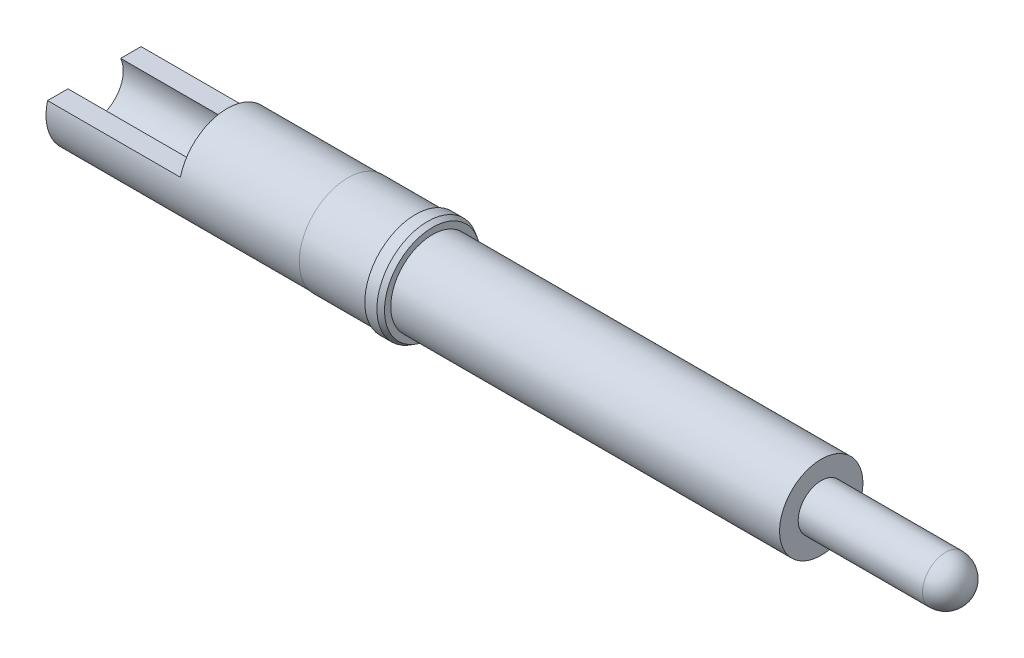
ISO-10303-21;
HEADER;
FILE_DESCRIPTION(('STEP AP214'),'2;1');
FILE_NAME('part.step','',(''),(''),'','','');
FILE_SCHEMA(('AUTOMOTIVE_DESIGN { 1 0 10303 214 1 1 1 1 }'));
ENDSEC;
DATA;
#1=APPLICATION_CONTEXT('core data for automotive mechanical design processes');
#2=APPLICATION_PROTOCOL_DEFINITION('international standard','automotive_design',2000,#1);
#3=PRODUCT_CONTEXT('',#1,'mechanical');
#4=PRODUCT('Part','Part','',(#3));
#5=PRODUCT_RELATED_PRODUCT_CATEGORY('part','',(#4));
#6=PRODUCT_DEFINITION_FORMATION('','',#4);
#7=PRODUCT_DEFINITION_CONTEXT('part definition',#1,'design');
#8=PRODUCT_DEFINITION('design','',#6,#7);
#9=PRODUCT_DEFINITION_SHAPE('','',#8);
#10=(LENGTH_UNIT() NAMED_UNIT(*) SI_UNIT(.MILLI.,.METRE.));
#11=(NAMED_UNIT(*) PLANE_ANGLE_UNIT() SI_UNIT($,.RADIAN.));
#12=(NAMED_UNIT(*) SI_UNIT($,.STERADIAN.) SOLID_ANGLE_UNIT());
#13=UNCERTAINTY_MEASURE_WITH_UNIT(LENGTH_MEASURE(1.E-05),#10,'distance_accuracy_value','');
#14=(GEOMETRIC_REPRESENTATION_CONTEXT(3) GLOBAL_UNCERTAINTY_ASSIGNED_CONTEXT((#13)) GLOBAL_UNIT_ASSIGNED_CONTEXT((#10,
#11,#12)) REPRESENTATION_CONTEXT('',''));
#15=CARTESIAN_POINT('',(0.,0.,0.));
#16=DIRECTION('',(0.,0.,1.));
#17=DIRECTION('',(1.,0.,0.));
#18=AXIS2_PLACEMENT_3D('',#15,#16,#17);
#19=CARTESIAN_POINT('',(0.,0.127,2.54));
#20=DIRECTION('',(0.,1.,0.));
#21=DIRECTION('',(0.,0.,1.));
#22=AXIS2_PLACEMENT_3D('',#19,#20,#21);
#23=PLANE('',#22);
#24=DIRECTION('',(-1.,0.,0.));
#25=VECTOR('',#24,1.);
#26=CARTESIAN_POINT('',(0.,0.127,-0.277081287711747));
#27=LINE('',#26,#25);
#28=CARTESIAN_POINT('',(0.,0.127,-0.277081287711747));
#29=VERTEX_POINT('',#28);
#30=CARTESIAN_POINT('',(1.397,0.127,-0.277081287711747));
#31=VERTEX_POINT('',#30);
#32=EDGE_CURVE('E88',#29,#31,#27,.F.);
#33=ORIENTED_EDGE('',*,*,#32,.T.);
#34=DIRECTION('',(0.,0.,-1.));
#35=VECTOR('',#34,1.);
#36=CARTESIAN_POINT('',(1.397,0.127,2.54));
#37=LINE('',#36,#35);
#38=CARTESIAN_POINT('',(1.397,0.127,-0.491868884968342));
#39=VERTEX_POINT('',#38);
#40=EDGE_CURVE('E106',#31,#39,#37,.T.);
#41=ORIENTED_EDGE('',*,*,#40,.T.);
#42=DIRECTION('',(-1.,0.,0.));
#43=VECTOR('',#42,1.);
#44=CARTESIAN_POINT('',(0.,0.127,-0.491868884968342));
#45=LINE('',#44,#43);
#46=CARTESIAN_POINT('',(0.,0.127,-0.491868884968342));
#47=VERTEX_POINT('',#46);
#48=EDGE_CURVE('E122',#39,#47,#45,.T.);
#49=ORIENTED_EDGE('',*,*,#48,.T.);
#50=DIRECTION('',(0.,0.,-1.));
#51=VECTOR('',#50,1.);
#52=CARTESIAN_POINT('',(0.,0.127,2.54));
#53=LINE('',#52,#51);
#54=EDGE_CURVE('E49',#29,#47,#53,.T.);
#55=ORIENTED_EDGE('',*,*,#54,.F.);
#56=EDGE_LOOP('',(#33,#41,#49,#55));
#57=FACE_BOUND('',#56,.T.);
#58=ADVANCED_FACE('F17',(#57),#23,.T.);
#59=CARTESIAN_POINT('',(2.667,0.,0.));
#60=DIRECTION('',(1.,0.,0.));
#61=DIRECTION('',(0.,0.861131258398696,-0.508382686377771));
#62=AXIS2_PLACEMENT_3D('',#59,#60,#61);
#63=PLANE('',#62);
#64=CARTESIAN_POINT('',(2.667,0.,0.));
#65=DIRECTION('',(1.,0.,0.));
#66=DIRECTION('',(0.,1.,0.));
#67=AXIS2_PLACEMENT_3D('',#64,#65,#66);
#68=CIRCLE('',#67,0.508);
#69=CARTESIAN_POINT('',(2.667,0.508,0.));
#70=VERTEX_POINT('',#69);
#71=EDGE_CURVE('E155',#70,#70,#68,.F.);
#72=ORIENTED_EDGE('',*,*,#71,.F.);
#73=EDGE_LOOP('',(#72));
#74=FACE_BOUND('',#73,.T.);
#75=CARTESIAN_POINT('',(2.667,0.,0.));
#76=DIRECTION('',(-1.,0.,0.));
#77=DIRECTION('',(0.,-0.861131258398696,0.508382686377771));
#78=AXIS2_PLACEMENT_3D('',#75,#76,#77);
#79=CIRCLE('',#78,0.51181);
#80=CARTESIAN_POINT('',(2.667,-0.440735589361037,0.260195342715007));
#81=VERTEX_POINT('',#80);
#82=EDGE_CURVE('E151',#81,#81,#79,.T.);
#83=ORIENTED_EDGE('',*,*,#82,.T.);
#84=EDGE_LOOP('',(#83));
#85=FACE_BOUND('',#84,.T.);
#86=ADVANCED_FACE('F179',(#74,#85),#63,.F.);
#87=CARTESIAN_POINT('',(2.667,0.,0.));
#88=DIRECTION('',(-1.,0.,0.));
#89=DIRECTION('',(0.,-0.861131258398696,0.508382686377771));
#90=AXIS2_PLACEMENT_3D('',#87,#88,#89);
#91=CYLINDRICAL_SURFACE('',#90,0.51181);
#92=ORIENTED_EDGE('',*,*,#82,.F.);
#93=EDGE_LOOP('',(#92));
#94=FACE_BOUND('',#93,.T.);
#95=CARTESIAN_POINT('',(3.3782,0.,0.));
#96=DIRECTION('',(-1.,0.,0.));
#97=DIRECTION('',(0.,-0.861131258398696,0.508382686377771));
#98=AXIS2_PLACEMENT_3D('',#95,#96,#97);
#99=CIRCLE('',#98,0.51181);
#100=CARTESIAN_POINT('',(3.3782,-0.440735589361037,0.260195342715007));
#101=VERTEX_POINT('',#100);
#102=EDGE_CURVE('E147',#101,#101,#99,.T.);
#103=ORIENTED_EDGE('',*,*,#102,.T.);
#104=EDGE_LOOP('',(#103));
#105=FACE_BOUND('',#104,.T.);
#106=ADVANCED_FACE('F186',(#94,#105),#91,.T.);
#107=CARTESIAN_POINT('',(3.3782,0.440735589361037,-0.260195342715007));
#108=DIRECTION('',(1.,0.,0.));
#109=DIRECTION('',(0.,0.861131258398696,-0.508382686377771));
#110=AXIS2_PLACEMENT_3D('',#107,#108,#109);
#111=PLANE('',#110);
#112=ORIENTED_EDGE('',*,*,#102,.F.);
#113=EDGE_LOOP('',(#112));
#114=FACE_BOUND('',#113,.T.);
#115=CARTESIAN_POINT('',(3.3782,0.,0.));
#116=DIRECTION('',(-1.,0.,0.));
#117=DIRECTION('',(0.,-0.861131258398696,0.508382686377771));
#118=AXIS2_PLACEMENT_3D('',#115,#116,#117);
#119=CIRCLE('',#118,0.5334);
#120=CARTESIAN_POINT('',(3.3782,-0.459327413229865,0.271171324913903));
#121=VERTEX_POINT('',#120);
#122=EDGE_CURVE('E143',#121,#121,#119,.T.);
#123=ORIENTED_EDGE('',*,*,#122,.T.);
#124=EDGE_LOOP('',(#123));
#125=FACE_BOUND('',#124,.T.);
#126=ADVANCED_FACE('F324',(#114,#125),#111,.F.);
#127=CARTESIAN_POINT('',(2.667,0.,0.));
#128=DIRECTION('',(-1.,0.,0.));
#129=DIRECTION('',(0.,-0.861131258398696,0.508382686377771));
#130=AXIS2_PLACEMENT_3D('',#127,#128,#129);
#131=CYLINDRICAL_SURFACE('',#130,0.5334);
#132=ORIENTED_EDGE('',*,*,#122,.F.);
#133=EDGE_LOOP('',(#132));
#134=FACE_BOUND('',#133,.T.);
#135=CARTESIAN_POINT('',(3.5052,0.,0.));
#136=DIRECTION('',(-1.,0.,0.));
#137=DIRECTION('',(0.,-0.861131258398696,0.508382686377771));
#138=AXIS2_PLACEMENT_3D('',#135,#136,#137);
#139=CIRCLE('',#138,0.5334);
#140=CARTESIAN_POINT('',(3.5052,-0.459327413229865,0.271171324913903));
#141=VERTEX_POINT('',#140);
#142=EDGE_CURVE('E139',#141,#141,#139,.T.);
#143=ORIENTED_EDGE('',*,*,#142,.T.);
#144=EDGE_LOOP('',(#143));
#145=FACE_BOUND('',#144,.T.);
#146=ADVANCED_FACE('F320',(#134,#145),#131,.T.);
#147=CARTESIAN_POINT('',(3.556,0.,0.));
#148=DIRECTION('',(-1.,0.,0.));
#149=DIRECTION('',(0.,-0.861131258398696,0.508382686377771));
#150=AXIS2_PLACEMENT_3D('',#147,#148,#149);
#151=CONICAL_SURFACE('',#150,0.504070606325167,0.5235987755983);
#152=ORIENTED_EDGE('',*,*,#142,.F.);
#153=EDGE_LOOP('',(#152));
#154=FACE_BOUND('',#153,.T.);
#155=CARTESIAN_POINT('',(3.556,0.,0.));
#156=DIRECTION('',(-1.,0.,0.));
#157=DIRECTION('',(0.,-0.861131258398696,0.508382686377771));
#158=AXIS2_PLACEMENT_3D('',#155,#156,#157);
#159=CIRCLE('',#158,0.504070606325167);
#160=CARTESIAN_POINT('',(3.556,-0.434070955546585,0.25626076896766));
#161=VERTEX_POINT('',#160);
#162=EDGE_CURVE('E135',#161,#161,#159,.T.);
#163=ORIENTED_EDGE('',*,*,#162,.T.);
#164=EDGE_LOOP('',(#163));
#165=FACE_BOUND('',#164,.T.);
#166=ADVANCED_FACE('F252',(#154,#165),#151,.T.);
#167=CARTESIAN_POINT('',(3.556,0.434070955546585,-0.25626076896766));
#168=DIRECTION('',(-1.,0.,0.));
#169=DIRECTION('',(0.,-0.861131258398696,0.508382686377771));
#170=AXIS2_PLACEMENT_3D('',#167,#168,#169);
#171=PLANE('',#170);
#172=ORIENTED_EDGE('',*,*,#162,.F.);
#173=EDGE_LOOP('',(#172));
#174=FACE_BOUND('',#173,.T.);
#175=CARTESIAN_POINT('',(3.556,0.,0.));
#176=DIRECTION('',(-1.,0.,0.));
#177=DIRECTION('',(0.,-0.861131258398696,0.508382686377771));
#178=AXIS2_PLACEMENT_3D('',#175,#176,#177);
#179=CIRCLE('',#178,0.43815);
#180=CARTESIAN_POINT('',(3.556,-0.377304660867389,0.22274787403642));
#181=VERTEX_POINT('',#180);
#182=EDGE_CURVE('E132',#181,#181,#179,.T.);
#183=ORIENTED_EDGE('',*,*,#182,.T.);
#184=EDGE_LOOP('',(#183));
#185=FACE_BOUND('',#184,.T.);
#186=ADVANCED_FACE('F245',(#174,#185),#171,.F.);
#187=CARTESIAN_POINT('',(2.667,0.,0.));
#188=DIRECTION('',(-1.,0.,0.));
#189=DIRECTION('',(0.,-0.861131258398696,0.508382686377771));
#190=AXIS2_PLACEMENT_3D('',#187,#188,#189);
#191=CYLINDRICAL_SURFACE('',#190,0.43815);
#192=ORIENTED_EDGE('',*,*,#182,.F.);
#193=EDGE_LOOP('',(#192));
#194=FACE_BOUND('',#193,.T.);
#195=CARTESIAN_POINT('',(7.6454,0.,0.));
#196=DIRECTION('',(-1.,0.,0.));
#197=DIRECTION('',(0.,-0.861131258398696,0.508382686377771));
#198=AXIS2_PLACEMENT_3D('',#195,#196,#197);
#199=CIRCLE('',#198,0.43815);
#200=CARTESIAN_POINT('',(7.6454,-0.377304660867389,0.22274787403642));
#201=VERTEX_POINT('',#200);
#202=EDGE_CURVE('E128',#201,#201,#199,.T.);
#203=ORIENTED_EDGE('',*,*,#202,.T.);
#204=EDGE_LOOP('',(#203));
#205=FACE_BOUND('',#204,.T.);
#206=ADVANCED_FACE('F251',(#194,#205),#191,.T.);
#207=CARTESIAN_POINT('',(7.6454,0.377304660867389,-0.22274787403642));
#208=DIRECTION('',(-1.,0.,0.));
#209=DIRECTION('',(0.,-0.861131258398696,0.508382686377771));
#210=AXIS2_PLACEMENT_3D('',#207,#208,#209);
#211=PLANE('',#210);
#212=CARTESIAN_POINT('',(7.6454,0.,0.));
#213=DIRECTION('',(-1.,0.,0.));
#214=DIRECTION('',(0.,-1.,0.));
#215=AXIS2_PLACEMENT_3D('',#212,#213,#214);
#216=CIRCLE('',#215,0.24257);
#217=CARTESIAN_POINT('',(7.6454,-0.242569999999999,0.));
#218=VERTEX_POINT('',#217);
#219=EDGE_CURVE('E11',#218,#218,#216,.T.);
#220=ORIENTED_EDGE('',*,*,#219,.T.);
#221=EDGE_LOOP('',(#220));
#222=FACE_BOUND('',#221,.T.);
#223=ORIENTED_EDGE('',*,*,#202,.F.);
#224=EDGE_LOOP('',(#223));
#225=FACE_BOUND('',#224,.T.);
#226=ADVANCED_FACE('F273',(#222,#225),#211,.F.);
#227=CARTESIAN_POINT('',(0.,0.,0.));
#228=DIRECTION('',(-1.,0.,0.));
#229=DIRECTION('',(0.,0.,1.));
#230=AXIS2_PLACEMENT_3D('',#227,#228,#229);
#231=CYLINDRICAL_SURFACE('',#230,0.508);
#232=ORIENTED_EDGE('',*,*,#71,.T.);
#233=EDGE_LOOP('',(#232));
#234=FACE_BOUND('',#233,.T.);
#235=ORIENTED_EDGE('',*,*,#48,.F.);
#236=CARTESIAN_POINT('',(1.397,0.,0.));
#237=DIRECTION('',(-1.,0.,0.));
#238=DIRECTION('',(0.,0.,1.));
#239=AXIS2_PLACEMENT_3D('',#236,#237,#238);
#240=CIRCLE('',#239,0.508);
#241=CARTESIAN_POINT('',(1.397,0.127,0.491868884968342));
#242=VERTEX_POINT('',#241);
#243=EDGE_CURVE('E115',#242,#39,#240,.T.);
#244=ORIENTED_EDGE('',*,*,#243,.F.);
#245=DIRECTION('',(-1.,0.,0.));
#246=VECTOR('',#245,1.);
#247=CARTESIAN_POINT('',(0.,0.127,0.491868884968342));
#248=LINE('',#247,#246);
#249=CARTESIAN_POINT('',(0.,0.127,0.491868884968342));
#250=VERTEX_POINT('',#249);
#251=EDGE_CURVE('E119',#250,#242,#248,.F.);
#252=ORIENTED_EDGE('',*,*,#251,.F.);
#253=CARTESIAN_POINT('',(0.,0.,0.));
#254=DIRECTION('',(-1.,0.,0.));
#255=DIRECTION('',(0.,0.,1.));
#256=AXIS2_PLACEMENT_3D('',#253,#254,#255);
#257=CIRCLE('',#256,0.508);
#258=EDGE_CURVE('E125',#47,#250,#257,.T.);
#259=ORIENTED_EDGE('',*,*,#258,.F.);
#260=EDGE_LOOP('',(#235,#244,#252,#259));
#261=FACE_BOUND('',#260,.T.);
#262=ADVANCED_FACE('F198',(#234,#261),#231,.T.);
#263=CARTESIAN_POINT('',(0.,0.508,0.));
#264=DIRECTION('',(1.,0.,0.));
#265=DIRECTION('',(0.,0.,-1.));
#266=AXIS2_PLACEMENT_3D('',#263,#264,#265);
#267=PLANE('',#266);
#268=CARTESIAN_POINT('',(0.,0.127,0.277081287711747));
#269=VERTEX_POINT('',#268);
#270=EDGE_CURVE('E111',#250,#269,#53,.T.);
#271=ORIENTED_EDGE('',*,*,#270,.T.);
#272=CARTESIAN_POINT('',(0.,0.,0.));
#273=DIRECTION('',(-1.,0.,0.));
#274=DIRECTION('',(0.,0.,1.));
#275=AXIS2_PLACEMENT_3D('',#272,#273,#274);
#276=CIRCLE('',#275,0.304799999999999);
#277=EDGE_CURVE('E96',#29,#269,#276,.T.);
#278=ORIENTED_EDGE('',*,*,#277,.F.);
#279=ORIENTED_EDGE('',*,*,#54,.T.);
#280=ORIENTED_EDGE('',*,*,#258,.T.);
#281=EDGE_LOOP('',(#271,#278,#279,#280));
#282=FACE_BOUND('',#281,.T.);
#283=ADVANCED_FACE('F191',(#282),#267,.F.);
#284=DIRECTION('',(-1.,0.,0.));
#285=VECTOR('',#284,1.);
#286=CARTESIAN_POINT('',(0.,0.127,0.277081287711747));
#287=LINE('',#286,#285);
#288=CARTESIAN_POINT('',(1.397,0.127,0.277081287711747));
#289=VERTEX_POINT('',#288);
#290=EDGE_CURVE('E37',#289,#269,#287,.T.);
#291=ORIENTED_EDGE('',*,*,#290,.T.);
#292=ORIENTED_EDGE('',*,*,#270,.F.);
#293=ORIENTED_EDGE('',*,*,#251,.T.);
#294=EDGE_CURVE('E107',#242,#289,#37,.T.);
#295=ORIENTED_EDGE('',*,*,#294,.T.);
#296=EDGE_LOOP('',(#291,#292,#293,#295));
#297=FACE_BOUND('',#296,.T.);
#298=ADVANCED_FACE('F182',(#297),#23,.T.);
#299=CARTESIAN_POINT('',(1.397,0.127,2.54));
#300=DIRECTION('',(-1.,0.,0.));
#301=DIRECTION('',(0.,0.,1.));
#302=AXIS2_PLACEMENT_3D('',#299,#300,#301);
#303=PLANE('',#302);
#304=CARTESIAN_POINT('',(1.397,0.,0.));
#305=DIRECTION('',(-1.,0.,0.));
#306=DIRECTION('',(0.,0.,1.));
#307=AXIS2_PLACEMENT_3D('',#304,#305,#306);
#308=CIRCLE('',#307,0.304799999999999);
#309=EDGE_CURVE('E103',#31,#289,#308,.F.);
#310=ORIENTED_EDGE('',*,*,#309,.T.);
#311=ORIENTED_EDGE('',*,*,#294,.F.);
#312=ORIENTED_EDGE('',*,*,#243,.T.);
#313=ORIENTED_EDGE('',*,*,#40,.F.);
#314=EDGE_LOOP('',(#310,#311,#312,#313));
#315=FACE_BOUND('',#314,.T.);
#316=ADVANCED_FACE('F176',(#315),#303,.T.);
#317=CARTESIAN_POINT('',(6.23508771087438,0.,0.));
#318=DIRECTION('',(-1.,0.,0.));
#319=DIRECTION('',(0.,-0.566000277102204,0.824405049911891));
#320=AXIS2_PLACEMENT_3D('',#317,#318,#319);
#321=CYLINDRICAL_SURFACE('',#320,0.24257);
#322=CARTESIAN_POINT('',(8.95223000000003,0.,0.));
#323=DIRECTION('',(-1.,0.,0.));
#324=DIRECTION('',(0.,-0.566000277102204,0.824405049911891));
#325=AXIS2_PLACEMENT_3D('',#322,#323,#324);
#326=CIRCLE('',#325,0.24257);
#327=CARTESIAN_POINT('',(8.95223000000003,-0.137294687216681,0.199975932957127));
#328=VERTEX_POINT('',#327);
#329=EDGE_CURVE('E26',#328,#328,#326,.T.);
#330=ORIENTED_EDGE('',*,*,#329,.T.);
#331=EDGE_LOOP('',(#330));
#332=FACE_BOUND('',#331,.T.);
#333=ORIENTED_EDGE('',*,*,#219,.F.);
#334=EDGE_LOOP('',(#333));
#335=FACE_BOUND('',#334,.T.);
#336=ADVANCED_FACE('F19',(#332,#335),#321,.T.);
#337=CARTESIAN_POINT('',(8.95223000000003,0.,0.));
#338=DIRECTION('',(-1.,0.,0.));
#339=DIRECTION('',(0.,0.824405049911891,0.566000277102204));
#340=AXIS2_PLACEMENT_3D('',#337,#338,#339);
#341=SPHERICAL_SURFACE('',#340,0.24257);
#342=ORIENTED_EDGE('',*,*,#329,.F.);
#343=EDGE_LOOP('',(#342));
#344=FACE_BOUND('',#343,.T.);
#345=ADVANCED_FACE('F168',(#344),#341,.T.);
#346=CARTESIAN_POINT('',(0.,0.,0.));
#347=DIRECTION('',(-1.,0.,0.));
#348=DIRECTION('',(0.,0.,1.));
#349=AXIS2_PLACEMENT_3D('',#346,#347,#348);
#350=CYLINDRICAL_SURFACE('',#349,0.304799999999999);
#351=CARTESIAN_POINT('',(2.54,0.,0.));
#352=DIRECTION('',(-1.,0.,0.));
#353=DIRECTION('',(0.,0.,1.));
#354=AXIS2_PLACEMENT_3D('',#351,#352,#353);
#355=CIRCLE('',#354,0.3048);
#356=CARTESIAN_POINT('',(2.54,0.,0.3048));
#357=VERTEX_POINT('',#356);
#358=EDGE_CURVE('E85',#357,#357,#355,.T.);
#359=ORIENTED_EDGE('',*,*,#358,.F.);
#360=EDGE_LOOP('',(#359));
#361=FACE_BOUND('',#360,.T.);
#362=ORIENTED_EDGE('',*,*,#32,.F.);
#363=ORIENTED_EDGE('',*,*,#277,.T.);
#364=ORIENTED_EDGE('',*,*,#290,.F.);
#365=ORIENTED_EDGE('',*,*,#309,.F.);
#366=EDGE_LOOP('',(#362,#363,#364,#365));
#367=FACE_BOUND('',#366,.T.);
#368=ADVANCED_FACE('F81',(#361,#367),#350,.F.);
#369=CARTESIAN_POINT('',(2.54,0.,0.));
#370=DIRECTION('',(-1.,0.,0.));
#371=DIRECTION('',(0.,0.,1.));
#372=AXIS2_PLACEMENT_3D('',#369,#370,#371);
#373=CONICAL_SURFACE('',#372,0.3048,1.02974425867666);
#374=CARTESIAN_POINT('',(2.7231423166796,0.,0.));
#375=VERTEX_POINT('',#374);
#376=VERTEX_LOOP('',#375);
#377=FACE_BOUND('',#376,.T.);
#378=ORIENTED_EDGE('',*,*,#358,.T.);
#379=EDGE_LOOP('',(#378));
#380=FACE_BOUND('',#379,.T.);
#381=ADVANCED_FACE('F78',(#377,#380),#373,.F.);
#382=CLOSED_SHELL('',(#58,#86,#106,#126,#146,#166,#186,#206,#226,#262,#283,#298,#316,#336,#345,
#368,#381));
#383=MANIFOLD_SOLID_BREP('B1',#382);
#384=ADVANCED_BREP_SHAPE_REPRESENTATION('',(#18,#383),#14);
#385=SHAPE_DEFINITION_REPRESENTATION(#9,#384);
ENDSEC;
END-ISO-10303-21;
